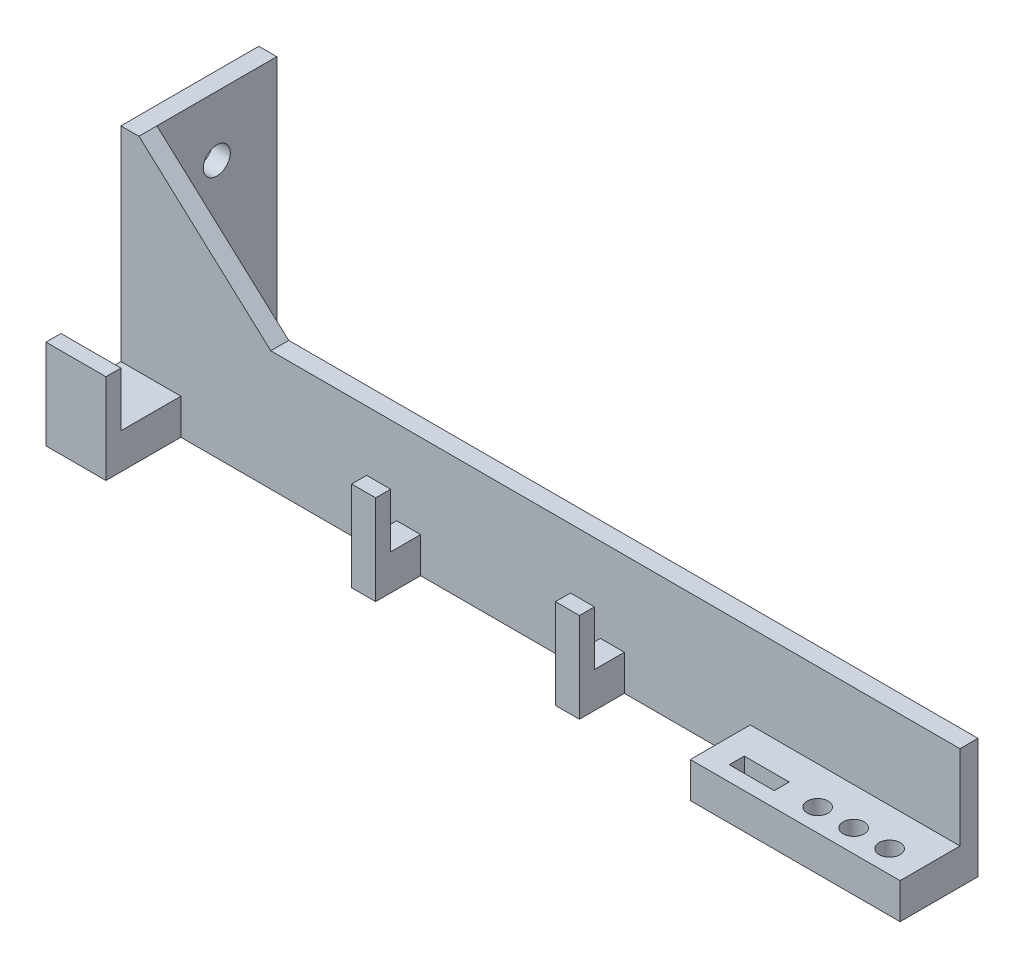
ISO-10303-21;
HEADER;
FILE_DESCRIPTION(('STEP AP214'),'2;1');
FILE_NAME('part.step','',(''),(''),'','','');
FILE_SCHEMA(('AUTOMOTIVE_DESIGN { 1 0 10303 214 1 1 1 1 }'));
ENDSEC;
DATA;
#1=APPLICATION_CONTEXT('core data for automotive mechanical design processes');
#2=APPLICATION_PROTOCOL_DEFINITION('international standard','automotive_design',2000,#1);
#3=PRODUCT_CONTEXT('',#1,'mechanical');
#4=PRODUCT('Part','Part','',(#3));
#5=PRODUCT_RELATED_PRODUCT_CATEGORY('part','',(#4));
#6=PRODUCT_DEFINITION_FORMATION('','',#4);
#7=PRODUCT_DEFINITION_CONTEXT('part definition',#1,'design');
#8=PRODUCT_DEFINITION('design','',#6,#7);
#9=PRODUCT_DEFINITION_SHAPE('','',#8);
#10=(LENGTH_UNIT() NAMED_UNIT(*) SI_UNIT(.MILLI.,.METRE.));
#11=(NAMED_UNIT(*) PLANE_ANGLE_UNIT() SI_UNIT($,.RADIAN.));
#12=(NAMED_UNIT(*) SI_UNIT($,.STERADIAN.) SOLID_ANGLE_UNIT());
#13=UNCERTAINTY_MEASURE_WITH_UNIT(LENGTH_MEASURE(1.E-05),#10,'distance_accuracy_value','');
#14=(GEOMETRIC_REPRESENTATION_CONTEXT(3) GLOBAL_UNCERTAINTY_ASSIGNED_CONTEXT((#13)) GLOBAL_UNIT_ASSIGNED_CONTEXT((#10,
#11,#12)) REPRESENTATION_CONTEXT('',''));
#15=CARTESIAN_POINT('',(0.,0.,0.));
#16=DIRECTION('',(0.,0.,1.));
#17=DIRECTION('',(1.,0.,0.));
#18=AXIS2_PLACEMENT_3D('',#15,#16,#17);
#19=CARTESIAN_POINT('',(140.,0.,-3.));
#20=DIRECTION('',(0.,0.,-1.));
#21=DIRECTION('',(0.,1.,0.));
#22=AXIS2_PLACEMENT_3D('',#19,#20,#21);
#23=PLANE('',#22);
#24=DIRECTION('',(-1.,0.,0.));
#25=VECTOR('',#24,1.);
#26=CARTESIAN_POINT('',(140.,-33.,-3.));
#27=LINE('',#26,#25);
#28=CARTESIAN_POINT('',(140.,-33.,-3.));
#29=VERTEX_POINT('',#28);
#30=CARTESIAN_POINT('',(3.,-33.,-3.));
#31=VERTEX_POINT('',#30);
#32=EDGE_CURVE('E515',#29,#31,#27,.T.);
#33=ORIENTED_EDGE('',*,*,#32,.T.);
#34=DIRECTION('',(0.,1.,0.));
#35=VECTOR('',#34,1.);
#36=CARTESIAN_POINT('',(3.,7.,-3.));
#37=LINE('',#36,#35);
#38=CARTESIAN_POINT('',(3.,7.,-3.));
#39=VERTEX_POINT('',#38);
#40=EDGE_CURVE('E272',#31,#39,#37,.T.);
#41=ORIENTED_EDGE('',*,*,#40,.T.);
#42=DIRECTION('',(0.739940073395944,-0.672672793996313,0.));
#43=VECTOR('',#42,1.);
#44=CARTESIAN_POINT('',(3.,7.,-3.));
#45=LINE('',#44,#43);
#46=CARTESIAN_POINT('',(25.,-13.,-3.));
#47=VERTEX_POINT('',#46);
#48=EDGE_CURVE('E247',#39,#47,#45,.T.);
#49=ORIENTED_EDGE('',*,*,#48,.T.);
#50=DIRECTION('',(-1.,0.,0.));
#51=VECTOR('',#50,1.);
#52=CARTESIAN_POINT('',(140.,-13.,-3.));
#53=LINE('',#52,#51);
#54=CARTESIAN_POINT('',(140.,-13.,-3.));
#55=VERTEX_POINT('',#54);
#56=EDGE_CURVE('E52',#55,#47,#53,.T.);
#57=ORIENTED_EDGE('',*,*,#56,.F.);
#58=DIRECTION('',(0.,-1.,0.));
#59=VECTOR('',#58,1.);
#60=CARTESIAN_POINT('',(140.,0.,-3.));
#61=LINE('',#60,#59);
#62=EDGE_CURVE('E509',#55,#29,#61,.T.);
#63=ORIENTED_EDGE('',*,*,#62,.T.);
#64=EDGE_LOOP('',(#33,#41,#49,#57,#63));
#65=FACE_BOUND('',#64,.T.);
#66=ADVANCED_FACE('F37',(#65),#23,.T.);
#67=CARTESIAN_POINT('',(140.,0.,0.));
#68=DIRECTION('',(0.,0.,-1.));
#69=DIRECTION('',(0.,1.,0.));
#70=AXIS2_PLACEMENT_3D('',#67,#68,#69);
#71=PLANE('',#70);
#72=DIRECTION('',(0.,-1.,0.));
#73=VECTOR('',#72,1.);
#74=CARTESIAN_POINT('',(105.,-33.,0.));
#75=LINE('',#74,#73);
#76=CARTESIAN_POINT('',(105.,-27.0594286753296,0.));
#77=VERTEX_POINT('',#76);
#78=CARTESIAN_POINT('',(105.,-33.,0.));
#79=VERTEX_POINT('',#78);
#80=EDGE_CURVE('E425',#77,#79,#75,.T.);
#81=ORIENTED_EDGE('',*,*,#80,.F.);
#82=DIRECTION('',(-1.,0.,0.));
#83=VECTOR('',#82,1.);
#84=CARTESIAN_POINT('',(105.,-27.0594286753296,0.));
#85=LINE('',#84,#83);
#86=CARTESIAN_POINT('',(140.,-27.0594286753296,0.));
#87=VERTEX_POINT('',#86);
#88=EDGE_CURVE('E430',#87,#77,#85,.T.);
#89=ORIENTED_EDGE('',*,*,#88,.F.);
#90=DIRECTION('',(0.,-1.,0.));
#91=VECTOR('',#90,1.);
#92=CARTESIAN_POINT('',(140.,0.,0.));
#93=LINE('',#92,#91);
#94=CARTESIAN_POINT('',(140.,-13.,0.));
#95=VERTEX_POINT('',#94);
#96=EDGE_CURVE('E503',#95,#87,#93,.T.);
#97=ORIENTED_EDGE('',*,*,#96,.F.);
#98=DIRECTION('',(-1.,0.,0.));
#99=VECTOR('',#98,1.);
#100=CARTESIAN_POINT('',(140.,-13.,0.));
#101=LINE('',#100,#99);
#102=CARTESIAN_POINT('',(25.,-13.,0.));
#103=VERTEX_POINT('',#102);
#104=EDGE_CURVE('E45',#95,#103,#101,.T.);
#105=ORIENTED_EDGE('',*,*,#104,.T.);
#106=DIRECTION('',(-0.739940073395944,0.672672793996313,0.));
#107=VECTOR('',#106,1.);
#108=CARTESIAN_POINT('',(3.,7.,0.));
#109=LINE('',#108,#107);
#110=CARTESIAN_POINT('',(3.,7.,0.));
#111=VERTEX_POINT('',#110);
#112=EDGE_CURVE('E246',#103,#111,#109,.T.);
#113=ORIENTED_EDGE('',*,*,#112,.T.);
#114=DIRECTION('',(-1.,0.,0.));
#115=VECTOR('',#114,1.);
#116=CARTESIAN_POINT('',(0.,7.,0.));
#117=LINE('',#116,#115);
#118=CARTESIAN_POINT('',(0.,7.,0.));
#119=VERTEX_POINT('',#118);
#120=EDGE_CURVE('E256',#111,#119,#117,.T.);
#121=ORIENTED_EDGE('',*,*,#120,.T.);
#122=DIRECTION('',(0.,-1.,0.));
#123=VECTOR('',#122,1.);
#124=CARTESIAN_POINT('',(0.,0.,0.));
#125=LINE('',#124,#123);
#126=CARTESIAN_POINT('',(0.,-27.0594286753296,0.));
#127=VERTEX_POINT('',#126);
#128=EDGE_CURVE('E499',#119,#127,#125,.T.);
#129=ORIENTED_EDGE('',*,*,#128,.T.);
#130=DIRECTION('',(-1.,0.,0.));
#131=VECTOR('',#130,1.);
#132=CARTESIAN_POINT('',(0.,-27.0594286753296,0.));
#133=LINE('',#132,#131);
#134=CARTESIAN_POINT('',(10.,-27.0594286753296,0.));
#135=VERTEX_POINT('',#134);
#136=EDGE_CURVE('E486',#135,#127,#133,.T.);
#137=ORIENTED_EDGE('',*,*,#136,.F.);
#138=DIRECTION('',(0.,1.,0.));
#139=VECTOR('',#138,1.);
#140=CARTESIAN_POINT('',(10.,-33.,0.));
#141=LINE('',#140,#139);
#142=CARTESIAN_POINT('',(10.,-33.,0.));
#143=VERTEX_POINT('',#142);
#144=EDGE_CURVE('E481',#143,#135,#141,.T.);
#145=ORIENTED_EDGE('',*,*,#144,.F.);
#146=DIRECTION('',(-1.,0.,0.));
#147=VECTOR('',#146,1.);
#148=CARTESIAN_POINT('',(140.,-33.,0.));
#149=LINE('',#148,#147);
#150=CARTESIAN_POINT('',(46.,-33.,0.));
#151=VERTEX_POINT('',#150);
#152=EDGE_CURVE('E518',#151,#143,#149,.T.);
#153=ORIENTED_EDGE('',*,*,#152,.F.);
#154=DIRECTION('',(0.,-1.,0.));
#155=VECTOR('',#154,1.);
#156=CARTESIAN_POINT('',(46.,-33.,0.));
#157=LINE('',#156,#155);
#158=CARTESIAN_POINT('',(46.,-27.0594286753296,0.));
#159=VERTEX_POINT('',#158);
#160=EDGE_CURVE('E470',#159,#151,#157,.T.);
#161=ORIENTED_EDGE('',*,*,#160,.F.);
#162=DIRECTION('',(-1.,0.,0.));
#163=VECTOR('',#162,1.);
#164=CARTESIAN_POINT('',(50.,-27.0594286753296,0.));
#165=LINE('',#164,#163);
#166=CARTESIAN_POINT('',(50.,-27.0594286753296,0.));
#167=VERTEX_POINT('',#166);
#168=EDGE_CURVE('E467',#167,#159,#165,.T.);
#169=ORIENTED_EDGE('',*,*,#168,.F.);
#170=DIRECTION('',(0.,1.,0.));
#171=VECTOR('',#170,1.);
#172=CARTESIAN_POINT('',(50.,-33.,0.));
#173=LINE('',#172,#171);
#174=CARTESIAN_POINT('',(50.,-33.,0.));
#175=VERTEX_POINT('',#174);
#176=EDGE_CURVE('E464',#175,#167,#173,.T.);
#177=ORIENTED_EDGE('',*,*,#176,.F.);
#178=CARTESIAN_POINT('',(80.,-33.,0.));
#179=VERTEX_POINT('',#178);
#180=EDGE_CURVE('E521',#179,#175,#149,.T.);
#181=ORIENTED_EDGE('',*,*,#180,.F.);
#182=DIRECTION('',(0.,-1.,0.));
#183=VECTOR('',#182,1.);
#184=CARTESIAN_POINT('',(80.,-33.,0.));
#185=LINE('',#184,#183);
#186=CARTESIAN_POINT('',(80.,-27.0594286753296,0.));
#187=VERTEX_POINT('',#186);
#188=EDGE_CURVE('E447',#187,#179,#185,.T.);
#189=ORIENTED_EDGE('',*,*,#188,.F.);
#190=DIRECTION('',(-1.,0.,0.));
#191=VECTOR('',#190,1.);
#192=CARTESIAN_POINT('',(80.,-27.0594286753296,0.));
#193=LINE('',#192,#191);
#194=CARTESIAN_POINT('',(84.,-27.0594286753296,0.));
#195=VERTEX_POINT('',#194);
#196=EDGE_CURVE('E453',#195,#187,#193,.T.);
#197=ORIENTED_EDGE('',*,*,#196,.F.);
#198=DIRECTION('',(0.,1.,0.));
#199=VECTOR('',#198,1.);
#200=CARTESIAN_POINT('',(84.,-33.,0.));
#201=LINE('',#200,#199);
#202=CARTESIAN_POINT('',(84.,-33.,0.));
#203=VERTEX_POINT('',#202);
#204=EDGE_CURVE('E450',#203,#195,#201,.T.);
#205=ORIENTED_EDGE('',*,*,#204,.F.);
#206=EDGE_CURVE('E519',#79,#203,#149,.T.);
#207=ORIENTED_EDGE('',*,*,#206,.F.);
#208=EDGE_LOOP('',(#81,#89,#97,#105,#113,#121,#129,#137,#145,#153,#161,#169,#177,#181,#189,#197,
#205,#207));
#209=FACE_BOUND('',#208,.T.);
#210=ADVANCED_FACE('F255',(#209),#71,.F.);
#211=CARTESIAN_POINT('',(140.,-13.,0.));
#212=DIRECTION('',(0.,-1.,0.));
#213=DIRECTION('',(0.,0.,-1.));
#214=AXIS2_PLACEMENT_3D('',#211,#212,#213);
#215=PLANE('',#214);
#216=ORIENTED_EDGE('',*,*,#56,.T.);
#217=DIRECTION('',(0.,0.,1.));
#218=VECTOR('',#217,1.);
#219=CARTESIAN_POINT('',(25.,-13.,-35.0156211871642));
#220=LINE('',#219,#218);
#221=EDGE_CURVE('E57',#47,#103,#220,.T.);
#222=ORIENTED_EDGE('',*,*,#221,.T.);
#223=ORIENTED_EDGE('',*,*,#104,.F.);
#224=DIRECTION('',(0.,0.,1.));
#225=VECTOR('',#224,1.);
#226=CARTESIAN_POINT('',(140.,-13.,0.));
#227=LINE('',#226,#225);
#228=EDGE_CURVE('E500',#55,#95,#227,.T.);
#229=ORIENTED_EDGE('',*,*,#228,.F.);
#230=EDGE_LOOP('',(#216,#222,#223,#229));
#231=FACE_BOUND('',#230,.T.);
#232=ADVANCED_FACE('F39',(#231),#215,.F.);
#233=CARTESIAN_POINT('',(140.,-33.,0.));
#234=DIRECTION('',(0.,1.,0.));
#235=DIRECTION('',(0.,0.,1.));
#236=AXIS2_PLACEMENT_3D('',#233,#234,#235);
#237=PLANE('',#236);
#238=CARTESIAN_POINT('',(134.5,-33.,6.25));
#239=DIRECTION('',(0.,1.,0.));
#240=DIRECTION('',(0.,0.,1.));
#241=AXIS2_PLACEMENT_3D('',#238,#239,#240);
#242=CIRCLE('',#241,1.75000000000001);
#243=CARTESIAN_POINT('',(134.5,-33.,8.00000000000001));
#244=VERTEX_POINT('',#243);
#245=EDGE_CURVE('E339',#244,#244,#242,.T.);
#246=ORIENTED_EDGE('',*,*,#245,.T.);
#247=EDGE_LOOP('',(#246));
#248=FACE_BOUND('',#247,.T.);
#249=DIRECTION('',(-1.,0.,0.));
#250=VECTOR('',#249,1.);
#251=CARTESIAN_POINT('',(140.,-33.,5.));
#252=LINE('',#251,#250);
#253=CARTESIAN_POINT('',(116.5,-33.,5.));
#254=VERTEX_POINT('',#253);
#255=CARTESIAN_POINT('',(109.,-33.,5.));
#256=VERTEX_POINT('',#255);
#257=EDGE_CURVE('E333',#254,#256,#252,.T.);
#258=ORIENTED_EDGE('',*,*,#257,.T.);
#259=DIRECTION('',(0.,0.,1.));
#260=VECTOR('',#259,1.);
#261=CARTESIAN_POINT('',(109.,-33.,0.));
#262=LINE('',#261,#260);
#263=CARTESIAN_POINT('',(109.,-33.,7.5));
#264=VERTEX_POINT('',#263);
#265=EDGE_CURVE('E336',#256,#264,#262,.T.);
#266=ORIENTED_EDGE('',*,*,#265,.T.);
#267=DIRECTION('',(1.,0.,0.));
#268=VECTOR('',#267,1.);
#269=CARTESIAN_POINT('',(140.,-33.,7.5));
#270=LINE('',#269,#268);
#271=CARTESIAN_POINT('',(116.5,-33.,7.5));
#272=VERTEX_POINT('',#271);
#273=EDGE_CURVE('E327',#264,#272,#270,.T.);
#274=ORIENTED_EDGE('',*,*,#273,.T.);
#275=DIRECTION('',(0.,0.,-1.));
#276=VECTOR('',#275,1.);
#277=CARTESIAN_POINT('',(116.5,-33.,0.));
#278=LINE('',#277,#276);
#279=EDGE_CURVE('E330',#272,#254,#278,.T.);
#280=ORIENTED_EDGE('',*,*,#279,.T.);
#281=EDGE_LOOP('',(#258,#266,#274,#280));
#282=FACE_BOUND('',#281,.T.);
#283=CARTESIAN_POINT('',(122.5,-33.,6.25));
#284=DIRECTION('',(0.,1.,0.));
#285=DIRECTION('',(0.,0.,1.));
#286=AXIS2_PLACEMENT_3D('',#283,#284,#285);
#287=CIRCLE('',#286,1.75);
#288=CARTESIAN_POINT('',(122.5,-33.,8.));
#289=VERTEX_POINT('',#288);
#290=EDGE_CURVE('E324',#289,#289,#287,.T.);
#291=ORIENTED_EDGE('',*,*,#290,.T.);
#292=EDGE_LOOP('',(#291));
#293=FACE_BOUND('',#292,.T.);
#294=CARTESIAN_POINT('',(128.5,-33.,6.25));
#295=DIRECTION('',(0.,1.,0.));
#296=DIRECTION('',(0.,0.,1.));
#297=AXIS2_PLACEMENT_3D('',#294,#295,#296);
#298=CIRCLE('',#297,1.75000000000001);
#299=CARTESIAN_POINT('',(128.5,-33.,8.00000000000001));
#300=VERTEX_POINT('',#299);
#301=EDGE_CURVE('E321',#300,#300,#298,.T.);
#302=ORIENTED_EDGE('',*,*,#301,.T.);
#303=EDGE_LOOP('',(#302));
#304=FACE_BOUND('',#303,.T.);
#305=DIRECTION('',(0.,0.,-1.));
#306=VECTOR('',#305,1.);
#307=CARTESIAN_POINT('',(84.,-33.,10.));
#308=LINE('',#307,#306);
#309=CARTESIAN_POINT('',(84.,-33.,7.5));
#310=VERTEX_POINT('',#309);
#311=EDGE_CURVE('E460',#310,#203,#308,.T.);
#312=ORIENTED_EDGE('',*,*,#311,.F.);
#313=DIRECTION('',(-1.,0.,0.));
#314=VECTOR('',#313,1.);
#315=CARTESIAN_POINT('',(80.,-33.,7.5));
#316=LINE('',#315,#314);
#317=CARTESIAN_POINT('',(80.,-33.,7.5));
#318=VERTEX_POINT('',#317);
#319=EDGE_CURVE('E342',#310,#318,#316,.T.);
#320=ORIENTED_EDGE('',*,*,#319,.T.);
#321=DIRECTION('',(0.,0.,-1.));
#322=VECTOR('',#321,1.);
#323=CARTESIAN_POINT('',(80.,-33.,10.));
#324=LINE('',#323,#322);
#325=EDGE_CURVE('E462',#318,#179,#324,.T.);
#326=ORIENTED_EDGE('',*,*,#325,.T.);
#327=ORIENTED_EDGE('',*,*,#180,.T.);
#328=DIRECTION('',(0.,0.,-1.));
#329=VECTOR('',#328,1.);
#330=CARTESIAN_POINT('',(50.,-33.,10.));
#331=LINE('',#330,#329);
#332=CARTESIAN_POINT('',(50.,-33.,7.5));
#333=VERTEX_POINT('',#332);
#334=EDGE_CURVE('E473',#333,#175,#331,.T.);
#335=ORIENTED_EDGE('',*,*,#334,.F.);
#336=DIRECTION('',(-1.,0.,0.));
#337=VECTOR('',#336,1.);
#338=CARTESIAN_POINT('',(46.,-33.,7.5));
#339=LINE('',#338,#337);
#340=CARTESIAN_POINT('',(46.,-33.,7.5));
#341=VERTEX_POINT('',#340);
#342=EDGE_CURVE('E361',#333,#341,#339,.T.);
#343=ORIENTED_EDGE('',*,*,#342,.T.);
#344=DIRECTION('',(0.,0.,-1.));
#345=VECTOR('',#344,1.);
#346=CARTESIAN_POINT('',(46.,-33.,10.));
#347=LINE('',#346,#345);
#348=EDGE_CURVE('E475',#341,#151,#347,.T.);
#349=ORIENTED_EDGE('',*,*,#348,.T.);
#350=ORIENTED_EDGE('',*,*,#152,.T.);
#351=DIRECTION('',(0.,0.,-1.));
#352=VECTOR('',#351,1.);
#353=CARTESIAN_POINT('',(10.,-33.,10.));
#354=LINE('',#353,#352);
#355=CARTESIAN_POINT('',(10.,-33.,12.5));
#356=VERTEX_POINT('',#355);
#357=EDGE_CURVE('E496',#356,#143,#354,.T.);
#358=ORIENTED_EDGE('',*,*,#357,.F.);
#359=DIRECTION('',(-1.,0.,0.));
#360=VECTOR('',#359,1.);
#361=CARTESIAN_POINT('',(0.,-33.,12.5));
#362=LINE('',#361,#360);
#363=CARTESIAN_POINT('',(0.,-33.,12.5));
#364=VERTEX_POINT('',#363);
#365=EDGE_CURVE('E388',#356,#364,#362,.T.);
#366=ORIENTED_EDGE('',*,*,#365,.T.);
#367=DIRECTION('',(0.,0.,-1.));
#368=VECTOR('',#367,1.);
#369=CARTESIAN_POINT('',(0.,-33.,0.));
#370=LINE('',#369,#368);
#371=CARTESIAN_POINT('',(0.,-33.,-23.));
#372=VERTEX_POINT('',#371);
#373=EDGE_CURVE('E504',#364,#372,#370,.T.);
#374=ORIENTED_EDGE('',*,*,#373,.T.);
#375=DIRECTION('',(-1.,0.,0.));
#376=VECTOR('',#375,1.);
#377=CARTESIAN_POINT('',(3.,-33.,-23.));
#378=LINE('',#377,#376);
#379=CARTESIAN_POINT('',(3.,-33.,-23.));
#380=VERTEX_POINT('',#379);
#381=EDGE_CURVE('E288',#380,#372,#378,.T.);
#382=ORIENTED_EDGE('',*,*,#381,.F.);
#383=DIRECTION('',(0.,0.,1.));
#384=VECTOR('',#383,1.);
#385=CARTESIAN_POINT('',(3.,-33.,-3.));
#386=LINE('',#385,#384);
#387=EDGE_CURVE('E281',#380,#31,#386,.T.);
#388=ORIENTED_EDGE('',*,*,#387,.T.);
#389=ORIENTED_EDGE('',*,*,#32,.F.);
#390=DIRECTION('',(0.,0.,-1.));
#391=VECTOR('',#390,1.);
#392=CARTESIAN_POINT('',(140.,-33.,0.));
#393=LINE('',#392,#391);
#394=CARTESIAN_POINT('',(140.,-33.,10.));
#395=VERTEX_POINT('',#394);
#396=EDGE_CURVE('E507',#395,#29,#393,.T.);
#397=ORIENTED_EDGE('',*,*,#396,.F.);
#398=DIRECTION('',(1.,0.,0.));
#399=VECTOR('',#398,1.);
#400=CARTESIAN_POINT('',(105.,-33.,10.));
#401=LINE('',#400,#399);
#402=CARTESIAN_POINT('',(105.,-33.,10.));
#403=VERTEX_POINT('',#402);
#404=EDGE_CURVE('E429',#403,#395,#401,.T.);
#405=ORIENTED_EDGE('',*,*,#404,.F.);
#406=DIRECTION('',(0.,0.,-1.));
#407=VECTOR('',#406,1.);
#408=CARTESIAN_POINT('',(105.,-33.,10.));
#409=LINE('',#408,#407);
#410=EDGE_CURVE('E445',#403,#79,#409,.T.);
#411=ORIENTED_EDGE('',*,*,#410,.T.);
#412=ORIENTED_EDGE('',*,*,#206,.T.);
#413=EDGE_LOOP('',(#312,#320,#326,#327,#335,#343,#349,#350,#358,#366,#374,#382,#388,#389,#397,
#405,#411,#412));
#414=FACE_BOUND('',#413,.T.);
#415=ADVANCED_FACE('F528',(#248,#282,#293,#304,#414),#237,.F.);
#416=CARTESIAN_POINT('',(140.,0.,0.));
#417=DIRECTION('',(1.,0.,0.));
#418=DIRECTION('',(0.,0.,-1.));
#419=AXIS2_PLACEMENT_3D('',#416,#417,#418);
#420=PLANE('',#419);
#421=ORIENTED_EDGE('',*,*,#228,.T.);
#422=ORIENTED_EDGE('',*,*,#96,.T.);
#423=DIRECTION('',(0.,0.,-1.));
#424=VECTOR('',#423,1.);
#425=CARTESIAN_POINT('',(140.,-27.0594286753296,10.));
#426=LINE('',#425,#424);
#427=CARTESIAN_POINT('',(140.,-27.0594286753296,10.));
#428=VERTEX_POINT('',#427);
#429=EDGE_CURVE('E443',#428,#87,#426,.T.);
#430=ORIENTED_EDGE('',*,*,#429,.F.);
#431=DIRECTION('',(0.,1.,0.));
#432=VECTOR('',#431,1.);
#433=CARTESIAN_POINT('',(140.,-33.,10.));
#434=LINE('',#433,#432);
#435=EDGE_CURVE('E433',#395,#428,#434,.T.);
#436=ORIENTED_EDGE('',*,*,#435,.F.);
#437=ORIENTED_EDGE('',*,*,#396,.T.);
#438=ORIENTED_EDGE('',*,*,#62,.F.);
#439=EDGE_LOOP('',(#421,#422,#430,#436,#437,#438));
#440=FACE_BOUND('',#439,.T.);
#441=ADVANCED_FACE('F575',(#440),#420,.T.);
#442=CARTESIAN_POINT('',(0.,0.,0.));
#443=DIRECTION('',(1.,0.,0.));
#444=DIRECTION('',(0.,0.,-1.));
#445=AXIS2_PLACEMENT_3D('',#442,#443,#444);
#446=PLANE('',#445);
#447=ORIENTED_EDGE('',*,*,#128,.F.);
#448=DIRECTION('',(0.,0.,-1.));
#449=VECTOR('',#448,1.);
#450=CARTESIAN_POINT('',(0.,7.,-3.));
#451=LINE('',#450,#449);
#452=CARTESIAN_POINT('',(0.,7.,-23.));
#453=VERTEX_POINT('',#452);
#454=EDGE_CURVE('E261',#119,#453,#451,.T.);
#455=ORIENTED_EDGE('',*,*,#454,.T.);
#456=DIRECTION('',(0.,-1.,0.));
#457=VECTOR('',#456,1.);
#458=CARTESIAN_POINT('',(0.,7.,-23.));
#459=LINE('',#458,#457);
#460=EDGE_CURVE('E276',#453,#372,#459,.T.);
#461=ORIENTED_EDGE('',*,*,#460,.T.);
#462=ORIENTED_EDGE('',*,*,#373,.F.);
#463=DIRECTION('',(0.,-1.,0.));
#464=VECTOR('',#463,1.);
#465=CARTESIAN_POINT('',(0.,-18.,12.5));
#466=LINE('',#465,#464);
#467=CARTESIAN_POINT('',(0.,-18.,12.5));
#468=VERTEX_POINT('',#467);
#469=EDGE_CURVE('E412',#468,#364,#466,.T.);
#470=ORIENTED_EDGE('',*,*,#469,.F.);
#471=DIRECTION('',(0.,0.,-1.));
#472=VECTOR('',#471,1.);
#473=CARTESIAN_POINT('',(0.,-18.,10.));
#474=LINE('',#473,#472);
#475=CARTESIAN_POINT('',(0.,-18.,10.));
#476=VERTEX_POINT('',#475);
#477=EDGE_CURVE('E397',#468,#476,#474,.T.);
#478=ORIENTED_EDGE('',*,*,#477,.T.);
#479=DIRECTION('',(0.,-1.,0.));
#480=VECTOR('',#479,1.);
#481=CARTESIAN_POINT('',(0.,-18.,10.));
#482=LINE('',#481,#480);
#483=CARTESIAN_POINT('',(0.,-27.0594286753296,10.));
#484=VERTEX_POINT('',#483);
#485=EDGE_CURVE('E409',#476,#484,#482,.T.);
#486=ORIENTED_EDGE('',*,*,#485,.T.);
#487=DIRECTION('',(0.,0.,-1.));
#488=VECTOR('',#487,1.);
#489=CARTESIAN_POINT('',(0.,-27.0594286753296,10.));
#490=LINE('',#489,#488);
#491=EDGE_CURVE('E485',#484,#127,#490,.T.);
#492=ORIENTED_EDGE('',*,*,#491,.T.);
#493=EDGE_LOOP('',(#447,#455,#461,#462,#470,#478,#486,#492));
#494=FACE_BOUND('',#493,.T.);
#495=CARTESIAN_POINT('',(0.,-3.,-13.));
#496=DIRECTION('',(-1.,0.,0.));
#497=DIRECTION('',(0.,0.,1.));
#498=AXIS2_PLACEMENT_3D('',#495,#496,#497);
#499=CIRCLE('',#498,2.25);
#500=CARTESIAN_POINT('',(0.,-3.,-10.75));
#501=VERTEX_POINT('',#500);
#502=EDGE_CURVE('E269',#501,#501,#499,.T.);
#503=ORIENTED_EDGE('',*,*,#502,.F.);
#504=EDGE_LOOP('',(#503));
#505=FACE_BOUND('',#504,.T.);
#506=ADVANCED_FACE('F543',(#494,#505),#446,.F.);
#507=CARTESIAN_POINT('',(10.,-33.,10.));
#508=DIRECTION('',(-1.,0.,0.));
#509=DIRECTION('',(0.,0.,1.));
#510=AXIS2_PLACEMENT_3D('',#507,#508,#509);
#511=PLANE('',#510);
#512=ORIENTED_EDGE('',*,*,#144,.T.);
#513=DIRECTION('',(0.,0.,-1.));
#514=VECTOR('',#513,1.);
#515=CARTESIAN_POINT('',(10.,-27.0594286753296,10.));
#516=LINE('',#515,#514);
#517=CARTESIAN_POINT('',(10.,-27.0594286753296,10.));
#518=VERTEX_POINT('',#517);
#519=EDGE_CURVE('E493',#518,#135,#516,.T.);
#520=ORIENTED_EDGE('',*,*,#519,.F.);
#521=DIRECTION('',(0.,-1.,0.));
#522=VECTOR('',#521,1.);
#523=CARTESIAN_POINT('',(10.,-18.,10.));
#524=LINE('',#523,#522);
#525=CARTESIAN_POINT('',(10.,-18.,10.));
#526=VERTEX_POINT('',#525);
#527=EDGE_CURVE('E419',#526,#518,#524,.T.);
#528=ORIENTED_EDGE('',*,*,#527,.F.);
#529=DIRECTION('',(0.,0.,1.));
#530=VECTOR('',#529,1.);
#531=CARTESIAN_POINT('',(10.,-18.,10.));
#532=LINE('',#531,#530);
#533=CARTESIAN_POINT('',(10.,-18.,12.5));
#534=VERTEX_POINT('',#533);
#535=EDGE_CURVE('E403',#526,#534,#532,.T.);
#536=ORIENTED_EDGE('',*,*,#535,.T.);
#537=DIRECTION('',(0.,-1.,0.));
#538=VECTOR('',#537,1.);
#539=CARTESIAN_POINT('',(10.,-18.,12.5));
#540=LINE('',#539,#538);
#541=EDGE_CURVE('E416',#534,#356,#540,.T.);
#542=ORIENTED_EDGE('',*,*,#541,.T.);
#543=ORIENTED_EDGE('',*,*,#357,.T.);
#544=EDGE_LOOP('',(#512,#520,#528,#536,#542,#543));
#545=FACE_BOUND('',#544,.T.);
#546=ADVANCED_FACE('F531',(#545),#511,.F.);
#547=CARTESIAN_POINT('',(0.,-27.0594286753296,10.));
#548=DIRECTION('',(0.,-1.,0.));
#549=DIRECTION('',(0.,0.,-1.));
#550=AXIS2_PLACEMENT_3D('',#547,#548,#549);
#551=PLANE('',#550);
#552=ORIENTED_EDGE('',*,*,#136,.T.);
#553=ORIENTED_EDGE('',*,*,#491,.F.);
#554=DIRECTION('',(-1.,0.,0.));
#555=VECTOR('',#554,1.);
#556=CARTESIAN_POINT('',(0.,-27.0594286753296,10.));
#557=LINE('',#556,#555);
#558=EDGE_CURVE('E482',#518,#484,#557,.T.);
#559=ORIENTED_EDGE('',*,*,#558,.F.);
#560=ORIENTED_EDGE('',*,*,#519,.T.);
#561=EDGE_LOOP('',(#552,#553,#559,#560));
#562=FACE_BOUND('',#561,.T.);
#563=ADVANCED_FACE('F546',(#562),#551,.F.);
#564=CARTESIAN_POINT('',(50.,-33.,10.));
#565=DIRECTION('',(-1.,0.,0.));
#566=DIRECTION('',(0.,0.,1.));
#567=AXIS2_PLACEMENT_3D('',#564,#565,#566);
#568=PLANE('',#567);
#569=DIRECTION('',(0.,0.,-1.));
#570=VECTOR('',#569,1.);
#571=CARTESIAN_POINT('',(50.,-27.0594286753296,10.));
#572=LINE('',#571,#570);
#573=CARTESIAN_POINT('',(50.,-27.0594286753296,5.));
#574=VERTEX_POINT('',#573);
#575=EDGE_CURVE('E479',#574,#167,#572,.T.);
#576=ORIENTED_EDGE('',*,*,#575,.F.);
#577=DIRECTION('',(0.,-1.,0.));
#578=VECTOR('',#577,1.);
#579=CARTESIAN_POINT('',(50.,-18.,5.));
#580=LINE('',#579,#578);
#581=CARTESIAN_POINT('',(50.,-18.,5.));
#582=VERTEX_POINT('',#581);
#583=EDGE_CURVE('E392',#582,#574,#580,.T.);
#584=ORIENTED_EDGE('',*,*,#583,.F.);
#585=DIRECTION('',(0.,0.,1.));
#586=VECTOR('',#585,1.);
#587=CARTESIAN_POINT('',(50.,-18.,5.));
#588=LINE('',#587,#586);
#589=CARTESIAN_POINT('',(50.,-18.,7.5));
#590=VERTEX_POINT('',#589);
#591=EDGE_CURVE('E376',#582,#590,#588,.T.);
#592=ORIENTED_EDGE('',*,*,#591,.T.);
#593=DIRECTION('',(0.,-1.,0.));
#594=VECTOR('',#593,1.);
#595=CARTESIAN_POINT('',(50.,-18.,7.5));
#596=LINE('',#595,#594);
#597=EDGE_CURVE('E389',#590,#333,#596,.T.);
#598=ORIENTED_EDGE('',*,*,#597,.T.);
#599=ORIENTED_EDGE('',*,*,#334,.T.);
#600=ORIENTED_EDGE('',*,*,#176,.T.);
#601=EDGE_LOOP('',(#576,#584,#592,#598,#599,#600));
#602=FACE_BOUND('',#601,.T.);
#603=ADVANCED_FACE('F843',(#602),#568,.F.);
#604=CARTESIAN_POINT('',(50.,-27.0594286753296,10.));
#605=DIRECTION('',(0.,-1.,0.));
#606=DIRECTION('',(0.,0.,-1.));
#607=AXIS2_PLACEMENT_3D('',#604,#605,#606);
#608=PLANE('',#607);
#609=DIRECTION('',(0.,0.,-1.));
#610=VECTOR('',#609,1.);
#611=CARTESIAN_POINT('',(46.,-27.0594286753296,10.));
#612=LINE('',#611,#610);
#613=CARTESIAN_POINT('',(46.,-27.0594286753296,5.));
#614=VERTEX_POINT('',#613);
#615=EDGE_CURVE('E477',#614,#159,#612,.T.);
#616=ORIENTED_EDGE('',*,*,#615,.F.);
#617=DIRECTION('',(1.,0.,0.));
#618=VECTOR('',#617,1.);
#619=CARTESIAN_POINT('',(50.,-27.0594286753296,5.));
#620=LINE('',#619,#618);
#621=EDGE_CURVE('E415',#614,#574,#620,.T.);
#622=ORIENTED_EDGE('',*,*,#621,.T.);
#623=ORIENTED_EDGE('',*,*,#575,.T.);
#624=ORIENTED_EDGE('',*,*,#168,.T.);
#625=EDGE_LOOP('',(#616,#622,#623,#624));
#626=FACE_BOUND('',#625,.T.);
#627=ADVANCED_FACE('F852',(#626),#608,.F.);
#628=CARTESIAN_POINT('',(46.,-33.,10.));
#629=DIRECTION('',(1.,0.,0.));
#630=DIRECTION('',(0.,0.,-1.));
#631=AXIS2_PLACEMENT_3D('',#628,#629,#630);
#632=PLANE('',#631);
#633=ORIENTED_EDGE('',*,*,#348,.F.);
#634=DIRECTION('',(0.,-1.,0.));
#635=VECTOR('',#634,1.);
#636=CARTESIAN_POINT('',(46.,-18.,7.5));
#637=LINE('',#636,#635);
#638=CARTESIAN_POINT('',(46.,-18.,7.5));
#639=VERTEX_POINT('',#638);
#640=EDGE_CURVE('E385',#639,#341,#637,.T.);
#641=ORIENTED_EDGE('',*,*,#640,.F.);
#642=DIRECTION('',(0.,0.,-1.));
#643=VECTOR('',#642,1.);
#644=CARTESIAN_POINT('',(46.,-18.,5.));
#645=LINE('',#644,#643);
#646=CARTESIAN_POINT('',(46.,-18.,5.));
#647=VERTEX_POINT('',#646);
#648=EDGE_CURVE('E370',#639,#647,#645,.T.);
#649=ORIENTED_EDGE('',*,*,#648,.T.);
#650=DIRECTION('',(0.,-1.,0.));
#651=VECTOR('',#650,1.);
#652=CARTESIAN_POINT('',(46.,-18.,5.));
#653=LINE('',#652,#651);
#654=EDGE_CURVE('E382',#647,#614,#653,.T.);
#655=ORIENTED_EDGE('',*,*,#654,.T.);
#656=ORIENTED_EDGE('',*,*,#615,.T.);
#657=ORIENTED_EDGE('',*,*,#160,.T.);
#658=EDGE_LOOP('',(#633,#641,#649,#655,#656,#657));
#659=FACE_BOUND('',#658,.T.);
#660=ADVANCED_FACE('F848',(#659),#632,.F.);
#661=CARTESIAN_POINT('',(80.,-33.,10.));
#662=DIRECTION('',(1.,0.,0.));
#663=DIRECTION('',(0.,0.,-1.));
#664=AXIS2_PLACEMENT_3D('',#661,#662,#663);
#665=PLANE('',#664);
#666=ORIENTED_EDGE('',*,*,#325,.F.);
#667=DIRECTION('',(0.,-1.,0.));
#668=VECTOR('',#667,1.);
#669=CARTESIAN_POINT('',(80.,-18.,7.5));
#670=LINE('',#669,#668);
#671=CARTESIAN_POINT('',(80.,-18.,7.5));
#672=VERTEX_POINT('',#671);
#673=EDGE_CURVE('E358',#672,#318,#670,.T.);
#674=ORIENTED_EDGE('',*,*,#673,.F.);
#675=DIRECTION('',(0.,0.,-1.));
#676=VECTOR('',#675,1.);
#677=CARTESIAN_POINT('',(80.,-18.,5.));
#678=LINE('',#677,#676);
#679=CARTESIAN_POINT('',(80.,-18.,5.));
#680=VERTEX_POINT('',#679);
#681=EDGE_CURVE('E343',#672,#680,#678,.T.);
#682=ORIENTED_EDGE('',*,*,#681,.T.);
#683=DIRECTION('',(0.,-1.,0.));
#684=VECTOR('',#683,1.);
#685=CARTESIAN_POINT('',(80.,-18.,5.));
#686=LINE('',#685,#684);
#687=CARTESIAN_POINT('',(80.,-27.0594286753296,5.));
#688=VERTEX_POINT('',#687);
#689=EDGE_CURVE('E355',#680,#688,#686,.T.);
#690=ORIENTED_EDGE('',*,*,#689,.T.);
#691=DIRECTION('',(0.,0.,-1.));
#692=VECTOR('',#691,1.);
#693=CARTESIAN_POINT('',(80.,-27.0594286753296,10.));
#694=LINE('',#693,#692);
#695=EDGE_CURVE('E456',#688,#187,#694,.T.);
#696=ORIENTED_EDGE('',*,*,#695,.T.);
#697=ORIENTED_EDGE('',*,*,#188,.T.);
#698=EDGE_LOOP('',(#666,#674,#682,#690,#696,#697));
#699=FACE_BOUND('',#698,.T.);
#700=ADVANCED_FACE('F831',(#699),#665,.F.);
#701=CARTESIAN_POINT('',(84.,-33.,10.));
#702=DIRECTION('',(-1.,0.,0.));
#703=DIRECTION('',(0.,0.,1.));
#704=AXIS2_PLACEMENT_3D('',#701,#702,#703);
#705=PLANE('',#704);
#706=DIRECTION('',(0.,0.,-1.));
#707=VECTOR('',#706,1.);
#708=CARTESIAN_POINT('',(84.,-27.0594286753296,10.));
#709=LINE('',#708,#707);
#710=CARTESIAN_POINT('',(84.,-27.0594286753296,5.));
#711=VERTEX_POINT('',#710);
#712=EDGE_CURVE('E458',#711,#195,#709,.T.);
#713=ORIENTED_EDGE('',*,*,#712,.F.);
#714=DIRECTION('',(0.,-1.,0.));
#715=VECTOR('',#714,1.);
#716=CARTESIAN_POINT('',(84.,-18.,5.));
#717=LINE('',#716,#715);
#718=CARTESIAN_POINT('',(84.,-18.,5.));
#719=VERTEX_POINT('',#718);
#720=EDGE_CURVE('E365',#719,#711,#717,.T.);
#721=ORIENTED_EDGE('',*,*,#720,.F.);
#722=DIRECTION('',(0.,0.,1.));
#723=VECTOR('',#722,1.);
#724=CARTESIAN_POINT('',(84.,-18.,5.));
#725=LINE('',#724,#723);
#726=CARTESIAN_POINT('',(84.,-18.,7.5));
#727=VERTEX_POINT('',#726);
#728=EDGE_CURVE('E349',#719,#727,#725,.T.);
#729=ORIENTED_EDGE('',*,*,#728,.T.);
#730=DIRECTION('',(0.,-1.,0.));
#731=VECTOR('',#730,1.);
#732=CARTESIAN_POINT('',(84.,-18.,7.5));
#733=LINE('',#732,#731);
#734=EDGE_CURVE('E362',#727,#310,#733,.T.);
#735=ORIENTED_EDGE('',*,*,#734,.T.);
#736=ORIENTED_EDGE('',*,*,#311,.T.);
#737=ORIENTED_EDGE('',*,*,#204,.T.);
#738=EDGE_LOOP('',(#713,#721,#729,#735,#736,#737));
#739=FACE_BOUND('',#738,.T.);
#740=ADVANCED_FACE('F826',(#739),#705,.F.);
#741=CARTESIAN_POINT('',(80.,-27.0594286753296,10.));
#742=DIRECTION('',(0.,-1.,0.));
#743=DIRECTION('',(0.,0.,-1.));
#744=AXIS2_PLACEMENT_3D('',#741,#742,#743);
#745=PLANE('',#744);
#746=ORIENTED_EDGE('',*,*,#695,.F.);
#747=DIRECTION('',(1.,0.,0.));
#748=VECTOR('',#747,1.);
#749=CARTESIAN_POINT('',(80.,-27.0594286753296,5.));
#750=LINE('',#749,#748);
#751=EDGE_CURVE('E11',#688,#711,#750,.T.);
#752=ORIENTED_EDGE('',*,*,#751,.T.);
#753=ORIENTED_EDGE('',*,*,#712,.T.);
#754=ORIENTED_EDGE('',*,*,#196,.T.);
#755=EDGE_LOOP('',(#746,#752,#753,#754));
#756=FACE_BOUND('',#755,.T.);
#757=ADVANCED_FACE('F837',(#756),#745,.F.);
#758=CARTESIAN_POINT('',(105.,-33.,10.));
#759=DIRECTION('',(1.,0.,0.));
#760=DIRECTION('',(0.,0.,-1.));
#761=AXIS2_PLACEMENT_3D('',#758,#759,#760);
#762=PLANE('',#761);
#763=ORIENTED_EDGE('',*,*,#80,.T.);
#764=ORIENTED_EDGE('',*,*,#410,.F.);
#765=DIRECTION('',(0.,-1.,0.));
#766=VECTOR('',#765,1.);
#767=CARTESIAN_POINT('',(105.,-33.,10.));
#768=LINE('',#767,#766);
#769=CARTESIAN_POINT('',(105.,-27.0594286753296,10.));
#770=VERTEX_POINT('',#769);
#771=EDGE_CURVE('E426',#770,#403,#768,.T.);
#772=ORIENTED_EDGE('',*,*,#771,.F.);
#773=DIRECTION('',(0.,0.,-1.));
#774=VECTOR('',#773,1.);
#775=CARTESIAN_POINT('',(105.,-27.0594286753296,10.));
#776=LINE('',#775,#774);
#777=EDGE_CURVE('E437',#770,#77,#776,.T.);
#778=ORIENTED_EDGE('',*,*,#777,.T.);
#779=EDGE_LOOP('',(#763,#764,#772,#778));
#780=FACE_BOUND('',#779,.T.);
#781=ADVANCED_FACE('F666',(#780),#762,.F.);
#782=CARTESIAN_POINT('',(105.,-27.0594286753296,10.));
#783=DIRECTION('',(0.,-1.,0.));
#784=DIRECTION('',(0.,0.,-1.));
#785=AXIS2_PLACEMENT_3D('',#782,#783,#784);
#786=PLANE('',#785);
#787=CARTESIAN_POINT('',(134.5,-27.0594286753296,6.25));
#788=DIRECTION('',(0.,1.,0.));
#789=DIRECTION('',(0.,0.,1.));
#790=AXIS2_PLACEMENT_3D('',#787,#788,#789);
#791=CIRCLE('',#790,1.75000000000001);
#792=CARTESIAN_POINT('',(134.5,-27.0594286753296,8.00000000000001));
#793=VERTEX_POINT('',#792);
#794=EDGE_CURVE('E291',#793,#793,#791,.T.);
#795=ORIENTED_EDGE('',*,*,#794,.F.);
#796=EDGE_LOOP('',(#795));
#797=FACE_BOUND('',#796,.T.);
#798=DIRECTION('',(1.,0.,0.));
#799=VECTOR('',#798,1.);
#800=CARTESIAN_POINT('',(109.,-27.0594286753296,7.5));
#801=LINE('',#800,#799);
#802=CARTESIAN_POINT('',(109.,-27.0594286753296,7.5));
#803=VERTEX_POINT('',#802);
#804=CARTESIAN_POINT('',(116.5,-27.0594286753296,7.5));
#805=VERTEX_POINT('',#804);
#806=EDGE_CURVE('E300',#803,#805,#801,.T.);
#807=ORIENTED_EDGE('',*,*,#806,.F.);
#808=DIRECTION('',(0.,0.,1.));
#809=VECTOR('',#808,1.);
#810=CARTESIAN_POINT('',(109.,-27.0594286753296,5.));
#811=LINE('',#810,#809);
#812=CARTESIAN_POINT('',(109.,-27.0594286753296,5.));
#813=VERTEX_POINT('',#812);
#814=EDGE_CURVE('E298',#813,#803,#811,.T.);
#815=ORIENTED_EDGE('',*,*,#814,.F.);
#816=DIRECTION('',(-1.,0.,0.));
#817=VECTOR('',#816,1.);
#818=CARTESIAN_POINT('',(109.,-27.0594286753296,5.));
#819=LINE('',#818,#817);
#820=CARTESIAN_POINT('',(116.5,-27.0594286753296,5.));
#821=VERTEX_POINT('',#820);
#822=EDGE_CURVE('E306',#821,#813,#819,.T.);
#823=ORIENTED_EDGE('',*,*,#822,.F.);
#824=DIRECTION('',(0.,0.,-1.));
#825=VECTOR('',#824,1.);
#826=CARTESIAN_POINT('',(116.5,-27.0594286753296,5.));
#827=LINE('',#826,#825);
#828=EDGE_CURVE('E303',#805,#821,#827,.T.);
#829=ORIENTED_EDGE('',*,*,#828,.F.);
#830=EDGE_LOOP('',(#807,#815,#823,#829));
#831=FACE_BOUND('',#830,.T.);
#832=CARTESIAN_POINT('',(122.5,-27.0594286753296,6.25));
#833=DIRECTION('',(0.,1.,0.));
#834=DIRECTION('',(0.,0.,1.));
#835=AXIS2_PLACEMENT_3D('',#832,#833,#834);
#836=CIRCLE('',#835,1.75);
#837=CARTESIAN_POINT('',(122.5,-27.0594286753296,8.));
#838=VERTEX_POINT('',#837);
#839=EDGE_CURVE('E293',#838,#838,#836,.T.);
#840=ORIENTED_EDGE('',*,*,#839,.F.);
#841=EDGE_LOOP('',(#840));
#842=FACE_BOUND('',#841,.T.);
#843=CARTESIAN_POINT('',(128.5,-27.0594286753296,6.25));
#844=DIRECTION('',(0.,1.,0.));
#845=DIRECTION('',(0.,0.,1.));
#846=AXIS2_PLACEMENT_3D('',#843,#844,#845);
#847=CIRCLE('',#846,1.75000000000001);
#848=CARTESIAN_POINT('',(128.5,-27.0594286753296,8.00000000000001));
#849=VERTEX_POINT('',#848);
#850=EDGE_CURVE('E296',#849,#849,#847,.T.);
#851=ORIENTED_EDGE('',*,*,#850,.F.);
#852=EDGE_LOOP('',(#851));
#853=FACE_BOUND('',#852,.T.);
#854=ORIENTED_EDGE('',*,*,#88,.T.);
#855=ORIENTED_EDGE('',*,*,#777,.F.);
#856=DIRECTION('',(-1.,0.,0.));
#857=VECTOR('',#856,1.);
#858=CARTESIAN_POINT('',(105.,-27.0594286753296,10.));
#859=LINE('',#858,#857);
#860=EDGE_CURVE('E435',#428,#770,#859,.T.);
#861=ORIENTED_EDGE('',*,*,#860,.F.);
#862=ORIENTED_EDGE('',*,*,#429,.T.);
#863=EDGE_LOOP('',(#854,#855,#861,#862));
#864=FACE_BOUND('',#863,.T.);
#865=ADVANCED_FACE('F562',(#797,#831,#842,#853,#864),#786,.F.);
#866=CARTESIAN_POINT('',(0.,0.,10.));
#867=DIRECTION('',(0.,0.,-1.));
#868=DIRECTION('',(-1.,0.,0.));
#869=AXIS2_PLACEMENT_3D('',#866,#867,#868);
#870=PLANE('',#869);
#871=ORIENTED_EDGE('',*,*,#771,.T.);
#872=ORIENTED_EDGE('',*,*,#404,.T.);
#873=ORIENTED_EDGE('',*,*,#435,.T.);
#874=ORIENTED_EDGE('',*,*,#860,.T.);
#875=EDGE_LOOP('',(#871,#872,#873,#874));
#876=FACE_BOUND('',#875,.T.);
#877=ADVANCED_FACE('F555',(#876),#870,.F.);
#878=CARTESIAN_POINT('',(0.,-18.,10.));
#879=DIRECTION('',(0.,0.,-1.));
#880=DIRECTION('',(-1.,0.,0.));
#881=AXIS2_PLACEMENT_3D('',#878,#879,#880);
#882=PLANE('',#881);
#883=ORIENTED_EDGE('',*,*,#558,.T.);
#884=ORIENTED_EDGE('',*,*,#485,.F.);
#885=DIRECTION('',(1.,0.,0.));
#886=VECTOR('',#885,1.);
#887=CARTESIAN_POINT('',(0.,-18.,10.));
#888=LINE('',#887,#886);
#889=EDGE_CURVE('E400',#476,#526,#888,.T.);
#890=ORIENTED_EDGE('',*,*,#889,.T.);
#891=ORIENTED_EDGE('',*,*,#527,.T.);
#892=EDGE_LOOP('',(#883,#884,#890,#891));
#893=FACE_BOUND('',#892,.T.);
#894=ADVANCED_FACE('F553',(#893),#882,.T.);
#895=CARTESIAN_POINT('',(0.,-18.,12.5));
#896=DIRECTION('',(0.,0.,1.));
#897=DIRECTION('',(1.,0.,0.));
#898=AXIS2_PLACEMENT_3D('',#895,#896,#897);
#899=PLANE('',#898);
#900=ORIENTED_EDGE('',*,*,#365,.F.);
#901=ORIENTED_EDGE('',*,*,#541,.F.);
#902=DIRECTION('',(-1.,0.,0.));
#903=VECTOR('',#902,1.);
#904=CARTESIAN_POINT('',(0.,-18.,12.5));
#905=LINE('',#904,#903);
#906=EDGE_CURVE('E406',#534,#468,#905,.T.);
#907=ORIENTED_EDGE('',*,*,#906,.T.);
#908=ORIENTED_EDGE('',*,*,#469,.T.);
#909=EDGE_LOOP('',(#900,#901,#907,#908));
#910=FACE_BOUND('',#909,.T.);
#911=ADVANCED_FACE('F536',(#910),#899,.T.);
#912=CARTESIAN_POINT('',(0.,-18.,0.));
#913=DIRECTION('',(0.,1.,0.));
#914=DIRECTION('',(0.,0.,1.));
#915=AXIS2_PLACEMENT_3D('',#912,#913,#914);
#916=PLANE('',#915);
#917=ORIENTED_EDGE('',*,*,#477,.F.);
#918=ORIENTED_EDGE('',*,*,#906,.F.);
#919=ORIENTED_EDGE('',*,*,#535,.F.);
#920=ORIENTED_EDGE('',*,*,#889,.F.);
#921=EDGE_LOOP('',(#917,#918,#919,#920));
#922=FACE_BOUND('',#921,.T.);
#923=ADVANCED_FACE('F552',(#922),#916,.T.);
#924=CARTESIAN_POINT('',(46.,-18.,5.));
#925=DIRECTION('',(0.,0.,-1.));
#926=DIRECTION('',(-1.,0.,0.));
#927=AXIS2_PLACEMENT_3D('',#924,#925,#926);
#928=PLANE('',#927);
#929=ORIENTED_EDGE('',*,*,#621,.F.);
#930=ORIENTED_EDGE('',*,*,#654,.F.);
#931=DIRECTION('',(1.,0.,0.));
#932=VECTOR('',#931,1.);
#933=CARTESIAN_POINT('',(46.,-18.,5.));
#934=LINE('',#933,#932);
#935=EDGE_CURVE('E373',#647,#582,#934,.T.);
#936=ORIENTED_EDGE('',*,*,#935,.T.);
#937=ORIENTED_EDGE('',*,*,#583,.T.);
#938=EDGE_LOOP('',(#929,#930,#936,#937));
#939=FACE_BOUND('',#938,.T.);
#940=ADVANCED_FACE('F623',(#939),#928,.T.);
#941=CARTESIAN_POINT('',(46.,-18.,7.5));
#942=DIRECTION('',(0.,0.,1.));
#943=DIRECTION('',(1.,0.,0.));
#944=AXIS2_PLACEMENT_3D('',#941,#942,#943);
#945=PLANE('',#944);
#946=ORIENTED_EDGE('',*,*,#342,.F.);
#947=ORIENTED_EDGE('',*,*,#597,.F.);
#948=DIRECTION('',(-1.,0.,0.));
#949=VECTOR('',#948,1.);
#950=CARTESIAN_POINT('',(46.,-18.,7.5));
#951=LINE('',#950,#949);
#952=EDGE_CURVE('E379',#590,#639,#951,.T.);
#953=ORIENTED_EDGE('',*,*,#952,.T.);
#954=ORIENTED_EDGE('',*,*,#640,.T.);
#955=EDGE_LOOP('',(#946,#947,#953,#954));
#956=FACE_BOUND('',#955,.T.);
#957=ADVANCED_FACE('F619',(#956),#945,.T.);
#958=CARTESIAN_POINT('',(0.,-18.,0.));
#959=DIRECTION('',(0.,1.,0.));
#960=DIRECTION('',(0.,0.,1.));
#961=AXIS2_PLACEMENT_3D('',#958,#959,#960);
#962=PLANE('',#961);
#963=ORIENTED_EDGE('',*,*,#648,.F.);
#964=ORIENTED_EDGE('',*,*,#952,.F.);
#965=ORIENTED_EDGE('',*,*,#591,.F.);
#966=ORIENTED_EDGE('',*,*,#935,.F.);
#967=EDGE_LOOP('',(#963,#964,#965,#966));
#968=FACE_BOUND('',#967,.T.);
#969=ADVANCED_FACE('F615',(#968),#962,.T.);
#970=CARTESIAN_POINT('',(80.,-18.,5.));
#971=DIRECTION('',(0.,0.,-1.));
#972=DIRECTION('',(-1.,0.,0.));
#973=AXIS2_PLACEMENT_3D('',#970,#971,#972);
#974=PLANE('',#973);
#975=ORIENTED_EDGE('',*,*,#751,.F.);
#976=ORIENTED_EDGE('',*,*,#689,.F.);
#977=DIRECTION('',(1.,0.,0.));
#978=VECTOR('',#977,1.);
#979=CARTESIAN_POINT('',(80.,-18.,5.));
#980=LINE('',#979,#978);
#981=EDGE_CURVE('E346',#680,#719,#980,.T.);
#982=ORIENTED_EDGE('',*,*,#981,.T.);
#983=ORIENTED_EDGE('',*,*,#720,.T.);
#984=EDGE_LOOP('',(#975,#976,#982,#983));
#985=FACE_BOUND('',#984,.T.);
#986=ADVANCED_FACE('F611',(#985),#974,.T.);
#987=CARTESIAN_POINT('',(80.,-18.,7.5));
#988=DIRECTION('',(0.,0.,1.));
#989=DIRECTION('',(1.,0.,0.));
#990=AXIS2_PLACEMENT_3D('',#987,#988,#989);
#991=PLANE('',#990);
#992=ORIENTED_EDGE('',*,*,#319,.F.);
#993=ORIENTED_EDGE('',*,*,#734,.F.);
#994=DIRECTION('',(-1.,0.,0.));
#995=VECTOR('',#994,1.);
#996=CARTESIAN_POINT('',(80.,-18.,7.5));
#997=LINE('',#996,#995);
#998=EDGE_CURVE('E352',#727,#672,#997,.T.);
#999=ORIENTED_EDGE('',*,*,#998,.T.);
#1000=ORIENTED_EDGE('',*,*,#673,.T.);
#1001=EDGE_LOOP('',(#992,#993,#999,#1000));
#1002=FACE_BOUND('',#1001,.T.);
#1003=ADVANCED_FACE('F602',(#1002),#991,.T.);
#1004=CARTESIAN_POINT('',(0.,-18.,0.));
#1005=DIRECTION('',(0.,1.,0.));
#1006=DIRECTION('',(0.,0.,1.));
#1007=AXIS2_PLACEMENT_3D('',#1004,#1005,#1006);
#1008=PLANE('',#1007);
#1009=ORIENTED_EDGE('',*,*,#681,.F.);
#1010=ORIENTED_EDGE('',*,*,#998,.F.);
#1011=ORIENTED_EDGE('',*,*,#728,.F.);
#1012=ORIENTED_EDGE('',*,*,#981,.F.);
#1013=EDGE_LOOP('',(#1009,#1010,#1011,#1012));
#1014=FACE_BOUND('',#1013,.T.);
#1015=ADVANCED_FACE('F592',(#1014),#1008,.T.);
#1016=CARTESIAN_POINT('',(128.5,-42.0594286753296,6.25));
#1017=DIRECTION('',(0.,1.,0.));
#1018=DIRECTION('',(0.,0.,1.));
#1019=AXIS2_PLACEMENT_3D('',#1016,#1017,#1018);
#1020=CYLINDRICAL_SURFACE('',#1019,1.75000000000001);
#1021=ORIENTED_EDGE('',*,*,#850,.T.);
#1022=EDGE_LOOP('',(#1021));
#1023=FACE_BOUND('',#1022,.T.);
#1024=ORIENTED_EDGE('',*,*,#301,.F.);
#1025=EDGE_LOOP('',(#1024));
#1026=FACE_BOUND('',#1025,.T.);
#1027=ADVANCED_FACE('F589',(#1023,#1026),#1020,.F.);
#1028=CARTESIAN_POINT('',(122.5,-42.0594286753296,6.25));
#1029=DIRECTION('',(0.,1.,0.));
#1030=DIRECTION('',(0.,0.,1.));
#1031=AXIS2_PLACEMENT_3D('',#1028,#1029,#1030);
#1032=CYLINDRICAL_SURFACE('',#1031,1.75);
#1033=ORIENTED_EDGE('',*,*,#839,.T.);
#1034=EDGE_LOOP('',(#1033));
#1035=FACE_BOUND('',#1034,.T.);
#1036=ORIENTED_EDGE('',*,*,#290,.F.);
#1037=EDGE_LOOP('',(#1036));
#1038=FACE_BOUND('',#1037,.T.);
#1039=ADVANCED_FACE('F591',(#1035,#1038),#1032,.F.);
#1040=CARTESIAN_POINT('',(109.,-42.0594286753296,5.));
#1041=DIRECTION('',(-1.,0.,0.));
#1042=DIRECTION('',(0.,0.,1.));
#1043=AXIS2_PLACEMENT_3D('',#1040,#1041,#1042);
#1044=PLANE('',#1043);
#1045=DIRECTION('',(0.,1.,0.));
#1046=VECTOR('',#1045,1.);
#1047=CARTESIAN_POINT('',(109.,-42.0594286753296,5.));
#1048=LINE('',#1047,#1046);
#1049=EDGE_CURVE('E297',#256,#813,#1048,.T.);
#1050=ORIENTED_EDGE('',*,*,#1049,.T.);
#1051=ORIENTED_EDGE('',*,*,#814,.T.);
#1052=DIRECTION('',(0.,1.,0.));
#1053=VECTOR('',#1052,1.);
#1054=CARTESIAN_POINT('',(109.,-42.0594286753296,7.5));
#1055=LINE('',#1054,#1053);
#1056=EDGE_CURVE('E309',#264,#803,#1055,.T.);
#1057=ORIENTED_EDGE('',*,*,#1056,.F.);
#1058=ORIENTED_EDGE('',*,*,#265,.F.);
#1059=EDGE_LOOP('',(#1050,#1051,#1057,#1058));
#1060=FACE_BOUND('',#1059,.T.);
#1061=ADVANCED_FACE('F599',(#1060),#1044,.F.);
#1062=CARTESIAN_POINT('',(109.,-42.0594286753296,5.));
#1063=DIRECTION('',(0.,0.,-1.));
#1064=DIRECTION('',(-1.,0.,0.));
#1065=AXIS2_PLACEMENT_3D('',#1062,#1063,#1064);
#1066=PLANE('',#1065);
#1067=DIRECTION('',(0.,1.,0.));
#1068=VECTOR('',#1067,1.);
#1069=CARTESIAN_POINT('',(116.5,-42.0594286753296,5.));
#1070=LINE('',#1069,#1068);
#1071=EDGE_CURVE('E311',#254,#821,#1070,.T.);
#1072=ORIENTED_EDGE('',*,*,#1071,.T.);
#1073=ORIENTED_EDGE('',*,*,#822,.T.);
#1074=ORIENTED_EDGE('',*,*,#1049,.F.);
#1075=ORIENTED_EDGE('',*,*,#257,.F.);
#1076=EDGE_LOOP('',(#1072,#1073,#1074,#1075));
#1077=FACE_BOUND('',#1076,.T.);
#1078=ADVANCED_FACE('F689',(#1077),#1066,.F.);
#1079=CARTESIAN_POINT('',(116.5,-42.0594286753296,5.));
#1080=DIRECTION('',(1.,0.,0.));
#1081=DIRECTION('',(0.,0.,-1.));
#1082=AXIS2_PLACEMENT_3D('',#1079,#1080,#1081);
#1083=PLANE('',#1082);
#1084=DIRECTION('',(0.,1.,0.));
#1085=VECTOR('',#1084,1.);
#1086=CARTESIAN_POINT('',(116.5,-42.0594286753296,7.5));
#1087=LINE('',#1086,#1085);
#1088=EDGE_CURVE('E313',#272,#805,#1087,.T.);
#1089=ORIENTED_EDGE('',*,*,#1088,.T.);
#1090=ORIENTED_EDGE('',*,*,#828,.T.);
#1091=ORIENTED_EDGE('',*,*,#1071,.F.);
#1092=ORIENTED_EDGE('',*,*,#279,.F.);
#1093=EDGE_LOOP('',(#1089,#1090,#1091,#1092));
#1094=FACE_BOUND('',#1093,.T.);
#1095=ADVANCED_FACE('F698',(#1094),#1083,.F.);
#1096=CARTESIAN_POINT('',(109.,-42.0594286753296,7.5));
#1097=DIRECTION('',(0.,0.,1.));
#1098=DIRECTION('',(1.,0.,0.));
#1099=AXIS2_PLACEMENT_3D('',#1096,#1097,#1098);
#1100=PLANE('',#1099);
#1101=ORIENTED_EDGE('',*,*,#1056,.T.);
#1102=ORIENTED_EDGE('',*,*,#806,.T.);
#1103=ORIENTED_EDGE('',*,*,#1088,.F.);
#1104=ORIENTED_EDGE('',*,*,#273,.F.);
#1105=EDGE_LOOP('',(#1101,#1102,#1103,#1104));
#1106=FACE_BOUND('',#1105,.T.);
#1107=ADVANCED_FACE('F708',(#1106),#1100,.F.);
#1108=CARTESIAN_POINT('',(134.5,-42.0594286753296,6.25));
#1109=DIRECTION('',(0.,1.,0.));
#1110=DIRECTION('',(0.,0.,1.));
#1111=AXIS2_PLACEMENT_3D('',#1108,#1109,#1110);
#1112=CYLINDRICAL_SURFACE('',#1111,1.75000000000001);
#1113=ORIENTED_EDGE('',*,*,#794,.T.);
#1114=EDGE_LOOP('',(#1113));
#1115=FACE_BOUND('',#1114,.T.);
#1116=ORIENTED_EDGE('',*,*,#245,.F.);
#1117=EDGE_LOOP('',(#1116));
#1118=FACE_BOUND('',#1117,.T.);
#1119=ADVANCED_FACE('F606',(#1115,#1118),#1112,.F.);
#1120=CARTESIAN_POINT('',(3.,7.,-23.));
#1121=DIRECTION('',(0.,0.,-1.));
#1122=DIRECTION('',(0.,1.,0.));
#1123=AXIS2_PLACEMENT_3D('',#1120,#1121,#1122);
#1124=PLANE('',#1123);
#1125=ORIENTED_EDGE('',*,*,#460,.F.);
#1126=DIRECTION('',(-1.,0.,0.));
#1127=VECTOR('',#1126,1.);
#1128=CARTESIAN_POINT('',(3.,7.,-23.));
#1129=LINE('',#1128,#1127);
#1130=CARTESIAN_POINT('',(3.,7.,-23.));
#1131=VERTEX_POINT('',#1130);
#1132=EDGE_CURVE('E284',#1131,#453,#1129,.T.);
#1133=ORIENTED_EDGE('',*,*,#1132,.F.);
#1134=DIRECTION('',(0.,-1.,0.));
#1135=VECTOR('',#1134,1.);
#1136=CARTESIAN_POINT('',(3.,7.,-23.));
#1137=LINE('',#1136,#1135);
#1138=EDGE_CURVE('E278',#1131,#380,#1137,.T.);
#1139=ORIENTED_EDGE('',*,*,#1138,.T.);
#1140=ORIENTED_EDGE('',*,*,#381,.T.);
#1141=EDGE_LOOP('',(#1125,#1133,#1139,#1140));
#1142=FACE_BOUND('',#1141,.T.);
#1143=ADVANCED_FACE('F540',(#1142),#1124,.T.);
#1144=CARTESIAN_POINT('',(3.,7.,-3.));
#1145=DIRECTION('',(0.,1.,0.));
#1146=DIRECTION('',(0.,0.,1.));
#1147=AXIS2_PLACEMENT_3D('',#1144,#1145,#1146);
#1148=PLANE('',#1147);
#1149=ORIENTED_EDGE('',*,*,#454,.F.);
#1150=ORIENTED_EDGE('',*,*,#120,.F.);
#1151=DIRECTION('',(0.,0.,1.));
#1152=VECTOR('',#1151,1.);
#1153=CARTESIAN_POINT('',(3.,7.,-35.0156211871642));
#1154=LINE('',#1153,#1152);
#1155=EDGE_CURVE('E243',#39,#111,#1154,.T.);
#1156=ORIENTED_EDGE('',*,*,#1155,.F.);
#1157=DIRECTION('',(0.,0.,-1.));
#1158=VECTOR('',#1157,1.);
#1159=CARTESIAN_POINT('',(3.,7.,-3.));
#1160=LINE('',#1159,#1158);
#1161=EDGE_CURVE('E275',#39,#1131,#1160,.T.);
#1162=ORIENTED_EDGE('',*,*,#1161,.T.);
#1163=ORIENTED_EDGE('',*,*,#1132,.T.);
#1164=EDGE_LOOP('',(#1149,#1150,#1156,#1162,#1163));
#1165=FACE_BOUND('',#1164,.T.);
#1166=ADVANCED_FACE('F259',(#1165),#1148,.T.);
#1167=CARTESIAN_POINT('',(3.,0.,0.));
#1168=DIRECTION('',(1.,0.,0.));
#1169=DIRECTION('',(0.,0.,-1.));
#1170=AXIS2_PLACEMENT_3D('',#1167,#1168,#1169);
#1171=PLANE('',#1170);
#1172=CARTESIAN_POINT('',(3.,-3.,-13.));
#1173=DIRECTION('',(-1.,0.,0.));
#1174=DIRECTION('',(0.,0.,1.));
#1175=AXIS2_PLACEMENT_3D('',#1172,#1173,#1174);
#1176=CIRCLE('',#1175,2.25);
#1177=CARTESIAN_POINT('',(3.,-3.,-10.75));
#1178=VERTEX_POINT('',#1177);
#1179=EDGE_CURVE('E266',#1178,#1178,#1176,.T.);
#1180=ORIENTED_EDGE('',*,*,#1179,.T.);
#1181=EDGE_LOOP('',(#1180));
#1182=FACE_BOUND('',#1181,.T.);
#1183=ORIENTED_EDGE('',*,*,#40,.F.);
#1184=ORIENTED_EDGE('',*,*,#387,.F.);
#1185=ORIENTED_EDGE('',*,*,#1138,.F.);
#1186=ORIENTED_EDGE('',*,*,#1161,.F.);
#1187=EDGE_LOOP('',(#1183,#1184,#1185,#1186));
#1188=FACE_BOUND('',#1187,.T.);
#1189=ADVANCED_FACE('F752',(#1182,#1188),#1171,.T.);
#1190=CARTESIAN_POINT('',(3.,-3.,-13.));
#1191=DIRECTION('',(-1.,0.,0.));
#1192=DIRECTION('',(0.,0.,1.));
#1193=AXIS2_PLACEMENT_3D('',#1190,#1191,#1192);
#1194=CYLINDRICAL_SURFACE('',#1193,2.25);
#1195=ORIENTED_EDGE('',*,*,#1179,.F.);
#1196=EDGE_LOOP('',(#1195));
#1197=FACE_BOUND('',#1196,.T.);
#1198=ORIENTED_EDGE('',*,*,#502,.T.);
#1199=EDGE_LOOP('',(#1198));
#1200=FACE_BOUND('',#1199,.T.);
#1201=ADVANCED_FACE('F748',(#1197,#1200),#1194,.F.);
#1202=CARTESIAN_POINT('',(3.,7.,-35.0156211871642));
#1203=DIRECTION('',(0.672672793996313,0.739940073395944,0.));
#1204=DIRECTION('',(-0.739940073395944,0.672672793996313,0.));
#1205=AXIS2_PLACEMENT_3D('',#1202,#1203,#1204);
#1206=PLANE('',#1205);
#1207=ORIENTED_EDGE('',*,*,#48,.F.);
#1208=ORIENTED_EDGE('',*,*,#1155,.T.);
#1209=ORIENTED_EDGE('',*,*,#112,.F.);
#1210=ORIENTED_EDGE('',*,*,#221,.F.);
#1211=EDGE_LOOP('',(#1207,#1208,#1209,#1210));
#1212=FACE_BOUND('',#1211,.T.);
#1213=ADVANCED_FACE('F245',(#1212),#1206,.T.);
#1214=CLOSED_SHELL('',(#66,#210,#232,#415,#441,#506,#546,#563,#603,#627,#660,#700,#740,#757,
#781,#865,#877,#894,#911,#923,#940,#957,#969,#986,#1003,#1015,#1027,#1039,#1061,#1078,#1095,
#1107,#1119,#1143,#1166,#1189,#1201,#1213));
#1215=MANIFOLD_SOLID_BREP('B2',#1214);
#1216=ADVANCED_BREP_SHAPE_REPRESENTATION('',(#18,#1215),#14);
#1217=SHAPE_DEFINITION_REPRESENTATION(#9,#1216);
ENDSEC;
END-ISO-10303-21;
